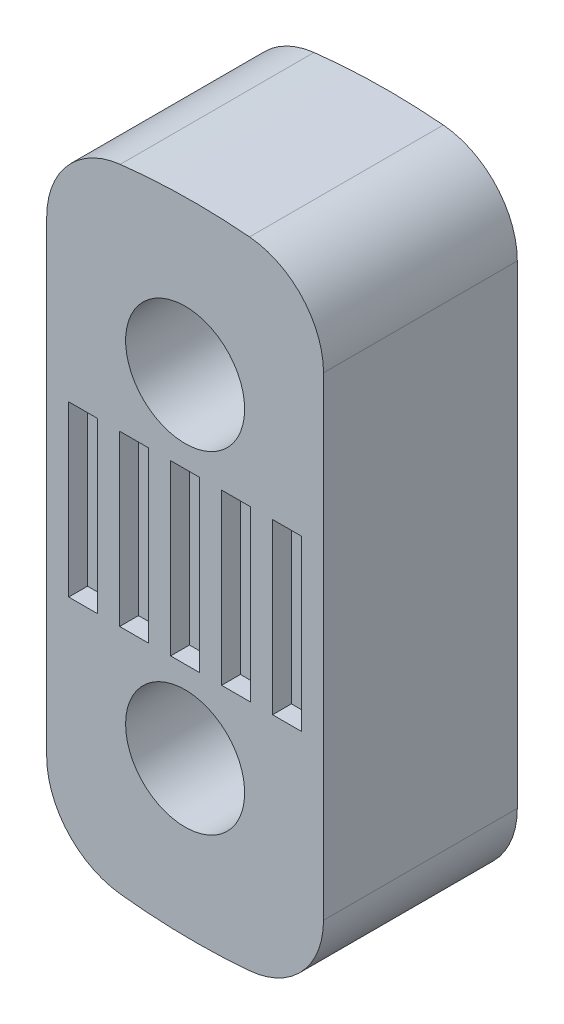
ISO-10303-21;
HEADER;
FILE_DESCRIPTION(('STEP AP214'),'2;1');
FILE_NAME('part.step','',(''),(''),'','','');
FILE_SCHEMA(('AUTOMOTIVE_DESIGN { 1 0 10303 214 1 1 1 1 }'));
ENDSEC;
DATA;
#1=APPLICATION_CONTEXT('core data for automotive mechanical design processes');
#2=APPLICATION_PROTOCOL_DEFINITION('international standard','automotive_design',2000,#1);
#3=PRODUCT_CONTEXT('',#1,'mechanical');
#4=PRODUCT('Part','Part','',(#3));
#5=PRODUCT_RELATED_PRODUCT_CATEGORY('part','',(#4));
#6=PRODUCT_DEFINITION_FORMATION('','',#4);
#7=PRODUCT_DEFINITION_CONTEXT('part definition',#1,'design');
#8=PRODUCT_DEFINITION('design','',#6,#7);
#9=PRODUCT_DEFINITION_SHAPE('','',#8);
#10=(LENGTH_UNIT() NAMED_UNIT(*) SI_UNIT(.MILLI.,.METRE.));
#11=(NAMED_UNIT(*) PLANE_ANGLE_UNIT() SI_UNIT($,.RADIAN.));
#12=(NAMED_UNIT(*) SI_UNIT($,.STERADIAN.) SOLID_ANGLE_UNIT());
#13=UNCERTAINTY_MEASURE_WITH_UNIT(LENGTH_MEASURE(1.E-05),#10,'distance_accuracy_value','');
#14=(GEOMETRIC_REPRESENTATION_CONTEXT(3) GLOBAL_UNCERTAINTY_ASSIGNED_CONTEXT((#13)) GLOBAL_UNIT_ASSIGNED_CONTEXT((#10,
#11,#12)) REPRESENTATION_CONTEXT('',''));
#15=CARTESIAN_POINT('',(0.,0.,0.));
#16=DIRECTION('',(0.,0.,1.));
#17=DIRECTION('',(1.,0.,0.));
#18=AXIS2_PLACEMENT_3D('',#15,#16,#17);
#19=CARTESIAN_POINT('',(-2.00158801806799,14.4344222229491,7.));
#20=DIRECTION('',(0.,0.,1.));
#21=DIRECTION('',(1.,0.,0.));
#22=AXIS2_PLACEMENT_3D('',#19,#20,#21);
#23=PLANE('',#22);
#24=DIRECTION('',(0.,-1.,0.));
#25=VECTOR('',#24,1.);
#26=CARTESIAN_POINT('',(3.15912,9.05440000000007,7.));
#27=LINE('',#26,#25);
#28=CARTESIAN_POINT('',(3.15912,9.05440000000007,7.));
#29=VERTEX_POINT('',#28);
#30=CARTESIAN_POINT('',(3.15912,2.94560000000003,7.));
#31=VERTEX_POINT('',#30);
#32=EDGE_CURVE('E57',#29,#31,#27,.T.);
#33=ORIENTED_EDGE('',*,*,#32,.F.);
#34=DIRECTION('',(-1.,0.,0.));
#35=VECTOR('',#34,1.);
#36=CARTESIAN_POINT('',(3.15912,9.05440000000007,7.));
#37=LINE('',#36,#35);
#38=CARTESIAN_POINT('',(4.2044,9.05440000000009,7.));
#39=VERTEX_POINT('',#38);
#40=EDGE_CURVE('E300',#39,#29,#37,.T.);
#41=ORIENTED_EDGE('',*,*,#40,.F.);
#42=DIRECTION('',(0.,1.,0.));
#43=VECTOR('',#42,1.);
#44=CARTESIAN_POINT('',(4.2044,9.05440000000009,7.));
#45=LINE('',#44,#43);
#46=CARTESIAN_POINT('',(4.2044,2.94560000000005,7.));
#47=VERTEX_POINT('',#46);
#48=EDGE_CURVE('E306',#47,#39,#45,.T.);
#49=ORIENTED_EDGE('',*,*,#48,.F.);
#50=DIRECTION('',(1.,0.,0.));
#51=VECTOR('',#50,1.);
#52=CARTESIAN_POINT('',(4.2044,2.94560000000005,7.));
#53=LINE('',#52,#51);
#54=EDGE_CURVE('E314',#31,#47,#53,.T.);
#55=ORIENTED_EDGE('',*,*,#54,.F.);
#56=EDGE_LOOP('',(#33,#41,#49,#55));
#57=FACE_BOUND('',#56,.T.);
#58=DIRECTION('',(0.,-1.,0.));
#59=VECTOR('',#58,1.);
#60=CARTESIAN_POINT('',(1.31824,9.05440000000004,7.));
#61=LINE('',#60,#59);
#62=CARTESIAN_POINT('',(1.31824,9.05440000000004,7.));
#63=VERTEX_POINT('',#62);
#64=CARTESIAN_POINT('',(1.31824,2.9456,7.));
#65=VERTEX_POINT('',#64);
#66=EDGE_CURVE('E68',#63,#65,#61,.T.);
#67=ORIENTED_EDGE('',*,*,#66,.F.);
#68=DIRECTION('',(-1.,0.,0.));
#69=VECTOR('',#68,1.);
#70=CARTESIAN_POINT('',(1.31824,9.05440000000004,7.));
#71=LINE('',#70,#69);
#72=CARTESIAN_POINT('',(2.36352,9.05440000000007,7.));
#73=VERTEX_POINT('',#72);
#74=EDGE_CURVE('E333',#73,#63,#71,.T.);
#75=ORIENTED_EDGE('',*,*,#74,.F.);
#76=DIRECTION('',(0.,1.,0.));
#77=VECTOR('',#76,1.);
#78=CARTESIAN_POINT('',(2.36352,9.05440000000007,7.));
#79=LINE('',#78,#77);
#80=CARTESIAN_POINT('',(2.36352,2.94560000000003,7.));
#81=VERTEX_POINT('',#80);
#82=EDGE_CURVE('E352',#81,#73,#79,.T.);
#83=ORIENTED_EDGE('',*,*,#82,.F.);
#84=DIRECTION('',(1.,0.,0.));
#85=VECTOR('',#84,1.);
#86=CARTESIAN_POINT('',(2.36352,2.94560000000003,7.));
#87=LINE('',#86,#85);
#88=EDGE_CURVE('E348',#65,#81,#87,.T.);
#89=ORIENTED_EDGE('',*,*,#88,.F.);
#90=EDGE_LOOP('',(#67,#75,#83,#89));
#91=FACE_BOUND('',#90,.T.);
#92=DIRECTION('',(0.,-1.,0.));
#93=VECTOR('',#92,1.);
#94=CARTESIAN_POINT('',(-0.522639999999999,9.05440000000002,7.));
#95=LINE('',#94,#93);
#96=CARTESIAN_POINT('',(-0.522639999999999,9.05440000000002,7.));
#97=VERTEX_POINT('',#96);
#98=CARTESIAN_POINT('',(-0.522639999999998,2.94559999999997,7.));
#99=VERTEX_POINT('',#98);
#100=EDGE_CURVE('E362',#97,#99,#95,.T.);
#101=ORIENTED_EDGE('',*,*,#100,.F.);
#102=DIRECTION('',(-1.,0.,0.));
#103=VECTOR('',#102,1.);
#104=CARTESIAN_POINT('',(-0.522639999999999,9.05440000000002,7.));
#105=LINE('',#104,#103);
#106=CARTESIAN_POINT('',(0.522640000000002,9.05440000000004,7.));
#107=VERTEX_POINT('',#106);
#108=EDGE_CURVE('E376',#107,#97,#105,.T.);
#109=ORIENTED_EDGE('',*,*,#108,.F.);
#110=DIRECTION('',(0.,1.,0.));
#111=VECTOR('',#110,1.);
#112=CARTESIAN_POINT('',(0.522640000000002,9.05440000000004,7.));
#113=LINE('',#112,#111);
#114=CARTESIAN_POINT('',(0.522640000000003,2.9456,7.));
#115=VERTEX_POINT('',#114);
#116=EDGE_CURVE('E395',#115,#107,#113,.T.);
#117=ORIENTED_EDGE('',*,*,#116,.F.);
#118=DIRECTION('',(1.,0.,0.));
#119=VECTOR('',#118,1.);
#120=CARTESIAN_POINT('',(0.522640000000003,2.9456,7.));
#121=LINE('',#120,#119);
#122=EDGE_CURVE('E391',#99,#115,#121,.T.);
#123=ORIENTED_EDGE('',*,*,#122,.F.);
#124=EDGE_LOOP('',(#101,#109,#117,#123));
#125=FACE_BOUND('',#124,.T.);
#126=DIRECTION('',(0.,-1.,0.));
#127=VECTOR('',#126,1.);
#128=CARTESIAN_POINT('',(-2.36352,9.05439999999999,7.));
#129=LINE('',#128,#127);
#130=CARTESIAN_POINT('',(-2.36352,9.05439999999999,7.));
#131=VERTEX_POINT('',#130);
#132=CARTESIAN_POINT('',(-2.36352,2.94559999999995,7.));
#133=VERTEX_POINT('',#132);
#134=EDGE_CURVE('E405',#131,#133,#129,.T.);
#135=ORIENTED_EDGE('',*,*,#134,.F.);
#136=DIRECTION('',(-1.,0.,0.));
#137=VECTOR('',#136,1.);
#138=CARTESIAN_POINT('',(-2.36352,9.05439999999999,7.));
#139=LINE('',#138,#137);
#140=CARTESIAN_POINT('',(-1.31824,9.05440000000002,7.));
#141=VERTEX_POINT('',#140);
#142=EDGE_CURVE('E420',#141,#131,#139,.T.);
#143=ORIENTED_EDGE('',*,*,#142,.F.);
#144=DIRECTION('',(0.,1.,0.));
#145=VECTOR('',#144,1.);
#146=CARTESIAN_POINT('',(-1.31824,9.05440000000002,7.));
#147=LINE('',#146,#145);
#148=CARTESIAN_POINT('',(-1.31824,2.94559999999997,7.));
#149=VERTEX_POINT('',#148);
#150=EDGE_CURVE('E438',#149,#141,#147,.T.);
#151=ORIENTED_EDGE('',*,*,#150,.F.);
#152=DIRECTION('',(1.,0.,0.));
#153=VECTOR('',#152,1.);
#154=CARTESIAN_POINT('',(-1.31824,2.94559999999997,7.));
#155=LINE('',#154,#153);
#156=EDGE_CURVE('E434',#133,#149,#155,.T.);
#157=ORIENTED_EDGE('',*,*,#156,.F.);
#158=EDGE_LOOP('',(#135,#143,#151,#157));
#159=FACE_BOUND('',#158,.T.);
#160=DIRECTION('',(0.,-1.,0.));
#161=VECTOR('',#160,1.);
#162=CARTESIAN_POINT('',(-4.2044,9.05439999999997,7.));
#163=LINE('',#162,#161);
#164=CARTESIAN_POINT('',(-4.2044,9.05439999999997,7.));
#165=VERTEX_POINT('',#164);
#166=CARTESIAN_POINT('',(-4.2044,2.94559999999992,7.));
#167=VERTEX_POINT('',#166);
#168=EDGE_CURVE('E448',#165,#167,#163,.T.);
#169=ORIENTED_EDGE('',*,*,#168,.F.);
#170=DIRECTION('',(-1.,0.,0.));
#171=VECTOR('',#170,1.);
#172=CARTESIAN_POINT('',(-4.2044,9.05439999999997,7.));
#173=LINE('',#172,#171);
#174=CARTESIAN_POINT('',(-3.15912,9.05439999999999,7.));
#175=VERTEX_POINT('',#174);
#176=EDGE_CURVE('E463',#175,#165,#173,.T.);
#177=ORIENTED_EDGE('',*,*,#176,.F.);
#178=DIRECTION('',(0.,1.,0.));
#179=VECTOR('',#178,1.);
#180=CARTESIAN_POINT('',(-3.15912,9.05439999999999,7.));
#181=LINE('',#180,#179);
#182=CARTESIAN_POINT('',(-3.15912,2.94559999999995,7.));
#183=VERTEX_POINT('',#182);
#184=EDGE_CURVE('E482',#183,#175,#181,.T.);
#185=ORIENTED_EDGE('',*,*,#184,.F.);
#186=DIRECTION('',(1.,0.,0.));
#187=VECTOR('',#186,1.);
#188=CARTESIAN_POINT('',(-3.15912,2.94559999999995,7.));
#189=LINE('',#188,#187);
#190=EDGE_CURVE('E478',#167,#183,#189,.T.);
#191=ORIENTED_EDGE('',*,*,#190,.F.);
#192=EDGE_LOOP('',(#169,#177,#185,#191));
#193=FACE_BOUND('',#192,.T.);
#194=CARTESIAN_POINT('',(0.,12.,7.));
#195=DIRECTION('',(0.,0.,1.));
#196=DIRECTION('',(1.,0.,0.));
#197=AXIS2_PLACEMENT_3D('',#194,#195,#196);
#198=CIRCLE('',#197,2.15);
#199=CARTESIAN_POINT('',(2.15000000000001,12.,7.));
#200=VERTEX_POINT('',#199);
#201=EDGE_CURVE('E510',#200,#200,#198,.T.);
#202=ORIENTED_EDGE('',*,*,#201,.F.);
#203=EDGE_LOOP('',(#202));
#204=FACE_BOUND('',#203,.T.);
#205=CARTESIAN_POINT('',(-2.00158801806799,14.4344222229491,7.));
#206=DIRECTION('',(0.,0.,1.));
#207=DIRECTION('',(1.,0.,0.));
#208=AXIS2_PLACEMENT_3D('',#205,#206,#207);
#209=CIRCLE('',#208,2.99841198193201);
#210=CARTESIAN_POINT('',(-2.34376728306027,17.4132454409335,7.));
#211=VERTEX_POINT('',#210);
#212=CARTESIAN_POINT('',(-5.,14.4344222229491,7.));
#213=VERTEX_POINT('',#212);
#214=EDGE_CURVE('E518',#211,#213,#209,.T.);
#215=ORIENTED_EDGE('',*,*,#214,.T.);
#216=DIRECTION('',(0.,-1.,0.));
#217=VECTOR('',#216,1.);
#218=CARTESIAN_POINT('',(-5.,14.4344222229491,7.));
#219=LINE('',#218,#217);
#220=CARTESIAN_POINT('',(-5.,-2.43442222294922,7.));
#221=VERTEX_POINT('',#220);
#222=EDGE_CURVE('E522',#213,#221,#219,.T.);
#223=ORIENTED_EDGE('',*,*,#222,.T.);
#224=CARTESIAN_POINT('',(-2.00158801806799,-2.43442222294922,7.));
#225=DIRECTION('',(0.,0.,1.));
#226=DIRECTION('',(-1.,0.,0.));
#227=AXIS2_PLACEMENT_3D('',#224,#225,#226);
#228=CIRCLE('',#227,2.99841198193201);
#229=CARTESIAN_POINT('',(-2.34376728306027,-5.41324544093359,7.));
#230=VERTEX_POINT('',#229);
#231=EDGE_CURVE('E526',#221,#230,#228,.T.);
#232=ORIENTED_EDGE('',*,*,#231,.T.);
#233=CARTESIAN_POINT('',(0.313805639653111,17.7221129386686,7.));
#234=DIRECTION('',(0.,0.,1.));
#235=DIRECTION('',(-1.,0.,0.));
#236=AXIS2_PLACEMENT_3D('',#233,#234,#235);
#237=CIRCLE('',#236,23.2874966707924);
#238=CARTESIAN_POINT('',(2.32681936940955,-5.47821630287409,7.));
#239=VERTEX_POINT('',#238);
#240=EDGE_CURVE('E529',#230,#239,#237,.T.);
#241=ORIENTED_EDGE('',*,*,#240,.T.);
#242=CARTESIAN_POINT('',(2.07388023446503,-2.56304929629146,7.));
#243=DIRECTION('',(0.,0.,1.));
#244=DIRECTION('',(-1.,0.,0.));
#245=AXIS2_PLACEMENT_3D('',#242,#243,#244);
#246=CIRCLE('',#245,2.92611976553497);
#247=CARTESIAN_POINT('',(5.,-2.56304929629146,7.));
#248=VERTEX_POINT('',#247);
#249=EDGE_CURVE('E531',#239,#248,#246,.T.);
#250=ORIENTED_EDGE('',*,*,#249,.T.);
#251=DIRECTION('',(0.,1.,0.));
#252=VECTOR('',#251,1.);
#253=CARTESIAN_POINT('',(5.,14.5630492962913,7.));
#254=LINE('',#253,#252);
#255=CARTESIAN_POINT('',(5.,14.5630492962913,7.));
#256=VERTEX_POINT('',#255);
#257=EDGE_CURVE('E533',#248,#256,#254,.T.);
#258=ORIENTED_EDGE('',*,*,#257,.T.);
#259=CARTESIAN_POINT('',(2.07388023446503,14.5630492962913,7.));
#260=DIRECTION('',(0.,0.,1.));
#261=DIRECTION('',(1.,0.,0.));
#262=AXIS2_PLACEMENT_3D('',#259,#260,#261);
#263=CIRCLE('',#262,2.92611976553497);
#264=CARTESIAN_POINT('',(2.32681936940955,17.478216302874,7.));
#265=VERTEX_POINT('',#264);
#266=EDGE_CURVE('E536',#256,#265,#263,.T.);
#267=ORIENTED_EDGE('',*,*,#266,.T.);
#268=CARTESIAN_POINT('',(0.313805639653111,-5.72211293866869,7.));
#269=DIRECTION('',(0.,0.,1.));
#270=DIRECTION('',(1.,0.,0.));
#271=AXIS2_PLACEMENT_3D('',#268,#269,#270);
#272=CIRCLE('',#271,23.2874966707924);
#273=EDGE_CURVE('E539',#265,#211,#272,.T.);
#274=ORIENTED_EDGE('',*,*,#273,.T.);
#275=EDGE_LOOP('',(#215,#223,#232,#241,#250,#258,#267,#274));
#276=FACE_BOUND('',#275,.T.);
#277=CARTESIAN_POINT('',(0.,0.,7.));
#278=DIRECTION('',(0.,0.,1.));
#279=DIRECTION('',(-1.,0.,0.));
#280=AXIS2_PLACEMENT_3D('',#277,#278,#279);
#281=CIRCLE('',#280,2.15);
#282=CARTESIAN_POINT('',(-2.15,0.,7.));
#283=VERTEX_POINT('',#282);
#284=EDGE_CURVE('E502',#283,#283,#281,.T.);
#285=ORIENTED_EDGE('',*,*,#284,.F.);
#286=EDGE_LOOP('',(#285));
#287=FACE_BOUND('',#286,.T.);
#288=ADVANCED_FACE('F38',(#57,#91,#125,#159,#193,#204,#276,#287),#23,.T.);
#289=CARTESIAN_POINT('',(-2.00158801806799,14.4344222229491,0.));
#290=DIRECTION('',(0.,0.,1.));
#291=DIRECTION('',(1.,0.,0.));
#292=AXIS2_PLACEMENT_3D('',#289,#290,#291);
#293=PLANE('',#292);
#294=CARTESIAN_POINT('',(0.,12.,0.));
#295=DIRECTION('',(0.,0.,1.));
#296=DIRECTION('',(1.,0.,0.));
#297=AXIS2_PLACEMENT_3D('',#294,#295,#296);
#298=CIRCLE('',#297,2.15);
#299=CARTESIAN_POINT('',(2.15000000000001,12.,0.));
#300=VERTEX_POINT('',#299);
#301=EDGE_CURVE('E506',#300,#300,#298,.T.);
#302=ORIENTED_EDGE('',*,*,#301,.T.);
#303=EDGE_LOOP('',(#302));
#304=FACE_BOUND('',#303,.T.);
#305=CARTESIAN_POINT('',(-2.00158801806799,14.4344222229491,0.));
#306=DIRECTION('',(0.,0.,1.));
#307=DIRECTION('',(1.,0.,0.));
#308=AXIS2_PLACEMENT_3D('',#305,#306,#307);
#309=CIRCLE('',#308,2.99841198193201);
#310=CARTESIAN_POINT('',(-2.34376728306027,17.4132454409335,0.));
#311=VERTEX_POINT('',#310);
#312=CARTESIAN_POINT('',(-5.,14.4344222229491,0.));
#313=VERTEX_POINT('',#312);
#314=EDGE_CURVE('E514',#311,#313,#309,.T.);
#315=ORIENTED_EDGE('',*,*,#314,.F.);
#316=CARTESIAN_POINT('',(0.313805639653111,-5.72211293866869,0.));
#317=DIRECTION('',(0.,0.,1.));
#318=DIRECTION('',(1.,0.,0.));
#319=AXIS2_PLACEMENT_3D('',#316,#317,#318);
#320=CIRCLE('',#319,23.2874966707924);
#321=CARTESIAN_POINT('',(2.32681936940955,17.478216302874,0.));
#322=VERTEX_POINT('',#321);
#323=EDGE_CURVE('E523',#322,#311,#320,.T.);
#324=ORIENTED_EDGE('',*,*,#323,.F.);
#325=CARTESIAN_POINT('',(2.07388023446503,14.5630492962913,0.));
#326=DIRECTION('',(0.,0.,1.));
#327=DIRECTION('',(1.,0.,0.));
#328=AXIS2_PLACEMENT_3D('',#325,#326,#327);
#329=CIRCLE('',#328,2.92611976553497);
#330=CARTESIAN_POINT('',(5.,14.5630492962913,0.));
#331=VERTEX_POINT('',#330);
#332=EDGE_CURVE('E562',#331,#322,#329,.T.);
#333=ORIENTED_EDGE('',*,*,#332,.F.);
#334=DIRECTION('',(0.,1.,0.));
#335=VECTOR('',#334,1.);
#336=CARTESIAN_POINT('',(5.,14.5630492962913,0.));
#337=LINE('',#336,#335);
#338=CARTESIAN_POINT('',(5.,-2.56304929629146,0.));
#339=VERTEX_POINT('',#338);
#340=EDGE_CURVE('E559',#339,#331,#337,.T.);
#341=ORIENTED_EDGE('',*,*,#340,.F.);
#342=CARTESIAN_POINT('',(2.07388023446503,-2.56304929629146,0.));
#343=DIRECTION('',(0.,0.,1.));
#344=DIRECTION('',(-1.,0.,0.));
#345=AXIS2_PLACEMENT_3D('',#342,#343,#344);
#346=CIRCLE('',#345,2.92611976553497);
#347=CARTESIAN_POINT('',(2.32681936940955,-5.47821630287409,0.));
#348=VERTEX_POINT('',#347);
#349=EDGE_CURVE('E556',#348,#339,#346,.T.);
#350=ORIENTED_EDGE('',*,*,#349,.F.);
#351=CARTESIAN_POINT('',(0.313805639653111,17.7221129386686,0.));
#352=DIRECTION('',(0.,0.,1.));
#353=DIRECTION('',(-1.,0.,0.));
#354=AXIS2_PLACEMENT_3D('',#351,#352,#353);
#355=CIRCLE('',#354,23.2874966707924);
#356=CARTESIAN_POINT('',(-2.34376728306027,-5.41324544093359,0.));
#357=VERTEX_POINT('',#356);
#358=EDGE_CURVE('E553',#357,#348,#355,.T.);
#359=ORIENTED_EDGE('',*,*,#358,.F.);
#360=CARTESIAN_POINT('',(-2.00158801806799,-2.43442222294922,0.));
#361=DIRECTION('',(0.,0.,1.));
#362=DIRECTION('',(-1.,0.,0.));
#363=AXIS2_PLACEMENT_3D('',#360,#361,#362);
#364=CIRCLE('',#363,2.99841198193201);
#365=CARTESIAN_POINT('',(-5.,-2.43442222294922,0.));
#366=VERTEX_POINT('',#365);
#367=EDGE_CURVE('E549',#366,#357,#364,.T.);
#368=ORIENTED_EDGE('',*,*,#367,.F.);
#369=DIRECTION('',(0.,-1.,0.));
#370=VECTOR('',#369,1.);
#371=CARTESIAN_POINT('',(-5.,14.4344222229491,0.));
#372=LINE('',#371,#370);
#373=EDGE_CURVE('E546',#313,#366,#372,.T.);
#374=ORIENTED_EDGE('',*,*,#373,.F.);
#375=EDGE_LOOP('',(#315,#324,#333,#341,#350,#359,#368,#374));
#376=FACE_BOUND('',#375,.T.);
#377=CARTESIAN_POINT('',(0.,0.,0.));
#378=DIRECTION('',(0.,0.,1.));
#379=DIRECTION('',(-1.,0.,0.));
#380=AXIS2_PLACEMENT_3D('',#377,#378,#379);
#381=CIRCLE('',#380,2.15);
#382=CARTESIAN_POINT('',(-2.15,0.,0.));
#383=VERTEX_POINT('',#382);
#384=EDGE_CURVE('E492',#383,#383,#381,.T.);
#385=ORIENTED_EDGE('',*,*,#384,.T.);
#386=EDGE_LOOP('',(#385));
#387=FACE_BOUND('',#386,.T.);
#388=ADVANCED_FACE('F598',(#304,#376,#387),#293,.F.);
#389=CARTESIAN_POINT('',(-2.00158801806799,14.4344222229491,7.));
#390=DIRECTION('',(0.,0.,-1.));
#391=DIRECTION('',(-1.,0.,0.));
#392=AXIS2_PLACEMENT_3D('',#389,#390,#391);
#393=CYLINDRICAL_SURFACE('',#392,2.99841198193201);
#394=ORIENTED_EDGE('',*,*,#314,.T.);
#395=DIRECTION('',(0.,0.,-1.));
#396=VECTOR('',#395,1.);
#397=CARTESIAN_POINT('',(-5.,14.4344222229491,7.));
#398=LINE('',#397,#396);
#399=EDGE_CURVE('E11',#213,#313,#398,.T.);
#400=ORIENTED_EDGE('',*,*,#399,.F.);
#401=ORIENTED_EDGE('',*,*,#214,.F.);
#402=DIRECTION('',(0.,0.,-1.));
#403=VECTOR('',#402,1.);
#404=CARTESIAN_POINT('',(-2.34376728306027,17.4132454409335,7.));
#405=LINE('',#404,#403);
#406=EDGE_CURVE('E542',#211,#311,#405,.T.);
#407=ORIENTED_EDGE('',*,*,#406,.T.);
#408=EDGE_LOOP('',(#394,#400,#401,#407));
#409=FACE_BOUND('',#408,.T.);
#410=ADVANCED_FACE('F40',(#409),#393,.T.);
#411=CARTESIAN_POINT('',(-5.,14.4344222229491,7.));
#412=DIRECTION('',(1.,0.,0.));
#413=DIRECTION('',(0.,1.,0.));
#414=AXIS2_PLACEMENT_3D('',#411,#412,#413);
#415=PLANE('',#414);
#416=ORIENTED_EDGE('',*,*,#373,.T.);
#417=DIRECTION('',(0.,0.,-1.));
#418=VECTOR('',#417,1.);
#419=CARTESIAN_POINT('',(-5.,-2.43442222294922,7.));
#420=LINE('',#419,#418);
#421=EDGE_CURVE('E47',#221,#366,#420,.T.);
#422=ORIENTED_EDGE('',*,*,#421,.F.);
#423=ORIENTED_EDGE('',*,*,#222,.F.);
#424=ORIENTED_EDGE('',*,*,#399,.T.);
#425=EDGE_LOOP('',(#416,#422,#423,#424));
#426=FACE_BOUND('',#425,.T.);
#427=ADVANCED_FACE('F616',(#426),#415,.F.);
#428=CARTESIAN_POINT('',(-2.00158801806799,-2.43442222294922,7.));
#429=DIRECTION('',(0.,0.,-1.));
#430=DIRECTION('',(-1.,0.,0.));
#431=AXIS2_PLACEMENT_3D('',#428,#429,#430);
#432=CYLINDRICAL_SURFACE('',#431,2.99841198193201);
#433=ORIENTED_EDGE('',*,*,#367,.T.);
#434=DIRECTION('',(0.,0.,-1.));
#435=VECTOR('',#434,1.);
#436=CARTESIAN_POINT('',(-2.34376728306027,-5.41324544093359,7.));
#437=LINE('',#436,#435);
#438=EDGE_CURVE('E585',#230,#357,#437,.T.);
#439=ORIENTED_EDGE('',*,*,#438,.F.);
#440=ORIENTED_EDGE('',*,*,#231,.F.);
#441=ORIENTED_EDGE('',*,*,#421,.T.);
#442=EDGE_LOOP('',(#433,#439,#440,#441));
#443=FACE_BOUND('',#442,.T.);
#444=ADVANCED_FACE('F593',(#443),#432,.T.);
#445=CARTESIAN_POINT('',(0.313805639653111,17.7221129386686,7.));
#446=DIRECTION('',(0.,0.,-1.));
#447=DIRECTION('',(-1.,0.,0.));
#448=AXIS2_PLACEMENT_3D('',#445,#446,#447);
#449=CYLINDRICAL_SURFACE('',#448,23.2874966707924);
#450=ORIENTED_EDGE('',*,*,#358,.T.);
#451=DIRECTION('',(0.,0.,-1.));
#452=VECTOR('',#451,1.);
#453=CARTESIAN_POINT('',(2.32681936940955,-5.47821630287409,7.));
#454=LINE('',#453,#452);
#455=EDGE_CURVE('E582',#239,#348,#454,.T.);
#456=ORIENTED_EDGE('',*,*,#455,.F.);
#457=ORIENTED_EDGE('',*,*,#240,.F.);
#458=ORIENTED_EDGE('',*,*,#438,.T.);
#459=EDGE_LOOP('',(#450,#456,#457,#458));
#460=FACE_BOUND('',#459,.T.);
#461=ADVANCED_FACE('F604',(#460),#449,.T.);
#462=CARTESIAN_POINT('',(2.07388023446503,-2.56304929629146,7.));
#463=DIRECTION('',(0.,0.,-1.));
#464=DIRECTION('',(-1.,0.,0.));
#465=AXIS2_PLACEMENT_3D('',#462,#463,#464);
#466=CYLINDRICAL_SURFACE('',#465,2.92611976553497);
#467=ORIENTED_EDGE('',*,*,#349,.T.);
#468=DIRECTION('',(0.,0.,-1.));
#469=VECTOR('',#468,1.);
#470=CARTESIAN_POINT('',(5.,-2.56304929629146,7.));
#471=LINE('',#470,#469);
#472=EDGE_CURVE('E579',#248,#339,#471,.T.);
#473=ORIENTED_EDGE('',*,*,#472,.F.);
#474=ORIENTED_EDGE('',*,*,#249,.F.);
#475=ORIENTED_EDGE('',*,*,#455,.T.);
#476=EDGE_LOOP('',(#467,#473,#474,#475));
#477=FACE_BOUND('',#476,.T.);
#478=ADVANCED_FACE('F608',(#477),#466,.T.);
#479=CARTESIAN_POINT('',(5.,14.5630492962913,7.));
#480=DIRECTION('',(-1.,0.,0.));
#481=DIRECTION('',(0.,-1.,0.));
#482=AXIS2_PLACEMENT_3D('',#479,#480,#481);
#483=PLANE('',#482);
#484=ORIENTED_EDGE('',*,*,#340,.T.);
#485=DIRECTION('',(0.,0.,-1.));
#486=VECTOR('',#485,1.);
#487=CARTESIAN_POINT('',(5.,14.5630492962913,7.));
#488=LINE('',#487,#486);
#489=EDGE_CURVE('E575',#256,#331,#488,.T.);
#490=ORIENTED_EDGE('',*,*,#489,.F.);
#491=ORIENTED_EDGE('',*,*,#257,.F.);
#492=ORIENTED_EDGE('',*,*,#472,.T.);
#493=EDGE_LOOP('',(#484,#490,#491,#492));
#494=FACE_BOUND('',#493,.T.);
#495=ADVANCED_FACE('F637',(#494),#483,.F.);
#496=CARTESIAN_POINT('',(2.07388023446503,14.5630492962913,7.));
#497=DIRECTION('',(0.,0.,-1.));
#498=DIRECTION('',(-1.,0.,0.));
#499=AXIS2_PLACEMENT_3D('',#496,#497,#498);
#500=CYLINDRICAL_SURFACE('',#499,2.92611976553497);
#501=ORIENTED_EDGE('',*,*,#332,.T.);
#502=DIRECTION('',(0.,0.,-1.));
#503=VECTOR('',#502,1.);
#504=CARTESIAN_POINT('',(2.32681936940955,17.478216302874,7.));
#505=LINE('',#504,#503);
#506=EDGE_CURVE('E571',#265,#322,#505,.T.);
#507=ORIENTED_EDGE('',*,*,#506,.F.);
#508=ORIENTED_EDGE('',*,*,#266,.F.);
#509=ORIENTED_EDGE('',*,*,#489,.T.);
#510=EDGE_LOOP('',(#501,#507,#508,#509));
#511=FACE_BOUND('',#510,.T.);
#512=ADVANCED_FACE('F623',(#511),#500,.T.);
#513=CARTESIAN_POINT('',(0.313805639653111,-5.72211293866869,7.));
#514=DIRECTION('',(0.,0.,-1.));
#515=DIRECTION('',(-1.,0.,0.));
#516=AXIS2_PLACEMENT_3D('',#513,#514,#515);
#517=CYLINDRICAL_SURFACE('',#516,23.2874966707924);
#518=ORIENTED_EDGE('',*,*,#323,.T.);
#519=ORIENTED_EDGE('',*,*,#406,.F.);
#520=ORIENTED_EDGE('',*,*,#273,.F.);
#521=ORIENTED_EDGE('',*,*,#506,.T.);
#522=EDGE_LOOP('',(#518,#519,#520,#521));
#523=FACE_BOUND('',#522,.T.);
#524=ADVANCED_FACE('F626',(#523),#517,.T.);
#525=CARTESIAN_POINT('',(0.,12.,7.));
#526=DIRECTION('',(0.,0.,-1.));
#527=DIRECTION('',(-1.,0.,0.));
#528=AXIS2_PLACEMENT_3D('',#525,#526,#527);
#529=CYLINDRICAL_SURFACE('',#528,2.15);
#530=ORIENTED_EDGE('',*,*,#201,.T.);
#531=EDGE_LOOP('',(#530));
#532=FACE_BOUND('',#531,.T.);
#533=ORIENTED_EDGE('',*,*,#301,.F.);
#534=EDGE_LOOP('',(#533));
#535=FACE_BOUND('',#534,.T.);
#536=ADVANCED_FACE('F628',(#532,#535),#529,.F.);
#537=CARTESIAN_POINT('',(0.,0.,7.));
#538=DIRECTION('',(0.,0.,-1.));
#539=DIRECTION('',(-1.,0.,0.));
#540=AXIS2_PLACEMENT_3D('',#537,#538,#539);
#541=CYLINDRICAL_SURFACE('',#540,2.15);
#542=ORIENTED_EDGE('',*,*,#284,.T.);
#543=EDGE_LOOP('',(#542));
#544=FACE_BOUND('',#543,.T.);
#545=ORIENTED_EDGE('',*,*,#384,.F.);
#546=EDGE_LOOP('',(#545));
#547=FACE_BOUND('',#546,.T.);
#548=ADVANCED_FACE('F634',(#544,#547),#541,.F.);
#549=CARTESIAN_POINT('',(-4.2044,9.05439999999997,6.32));
#550=DIRECTION('',(-1.,0.,0.));
#551=DIRECTION('',(0.,0.,1.));
#552=AXIS2_PLACEMENT_3D('',#549,#550,#551);
#553=PLANE('',#552);
#554=ORIENTED_EDGE('',*,*,#168,.T.);
#555=DIRECTION('',(0.,0.,1.));
#556=VECTOR('',#555,1.);
#557=CARTESIAN_POINT('',(-4.2044,2.94559999999992,6.32));
#558=LINE('',#557,#556);
#559=CARTESIAN_POINT('',(-4.2044,2.94559999999992,6.32));
#560=VERTEX_POINT('',#559);
#561=EDGE_CURVE('E475',#560,#167,#558,.T.);
#562=ORIENTED_EDGE('',*,*,#561,.F.);
#563=DIRECTION('',(0.,-1.,0.));
#564=VECTOR('',#563,1.);
#565=CARTESIAN_POINT('',(-4.2044,9.05439999999997,6.32));
#566=LINE('',#565,#564);
#567=CARTESIAN_POINT('',(-4.2044,9.05439999999997,6.32));
#568=VERTEX_POINT('',#567);
#569=EDGE_CURVE('E458',#568,#560,#566,.T.);
#570=ORIENTED_EDGE('',*,*,#569,.F.);
#571=DIRECTION('',(0.,0.,1.));
#572=VECTOR('',#571,1.);
#573=CARTESIAN_POINT('',(-4.2044,9.05439999999997,6.32));
#574=LINE('',#573,#572);
#575=EDGE_CURVE('E489',#568,#165,#574,.T.);
#576=ORIENTED_EDGE('',*,*,#575,.T.);
#577=EDGE_LOOP('',(#554,#562,#570,#576));
#578=FACE_BOUND('',#577,.T.);
#579=ADVANCED_FACE('F651',(#578),#553,.F.);
#580=CARTESIAN_POINT('',(-4.2044,9.05439999999997,6.32));
#581=DIRECTION('',(0.,1.,0.));
#582=DIRECTION('',(-1.,0.,0.));
#583=AXIS2_PLACEMENT_3D('',#580,#581,#582);
#584=PLANE('',#583);
#585=ORIENTED_EDGE('',*,*,#176,.T.);
#586=ORIENTED_EDGE('',*,*,#575,.F.);
#587=DIRECTION('',(-1.,0.,0.));
#588=VECTOR('',#587,1.);
#589=CARTESIAN_POINT('',(-4.2044,9.05439999999997,6.32));
#590=LINE('',#589,#588);
#591=CARTESIAN_POINT('',(-3.15912,9.05439999999999,6.32));
#592=VERTEX_POINT('',#591);
#593=EDGE_CURVE('E471',#592,#568,#590,.T.);
#594=ORIENTED_EDGE('',*,*,#593,.F.);
#595=DIRECTION('',(0.,0.,1.));
#596=VECTOR('',#595,1.);
#597=CARTESIAN_POINT('',(-3.15912,9.05439999999999,6.32));
#598=LINE('',#597,#596);
#599=EDGE_CURVE('E493',#592,#175,#598,.T.);
#600=ORIENTED_EDGE('',*,*,#599,.T.);
#601=EDGE_LOOP('',(#585,#586,#594,#600));
#602=FACE_BOUND('',#601,.T.);
#603=ADVANCED_FACE('F655',(#602),#584,.F.);
#604=CARTESIAN_POINT('',(-3.15912,9.05439999999999,6.32));
#605=DIRECTION('',(1.,0.,0.));
#606=DIRECTION('',(0.,1.,0.));
#607=AXIS2_PLACEMENT_3D('',#604,#605,#606);
#608=PLANE('',#607);
#609=ORIENTED_EDGE('',*,*,#184,.T.);
#610=ORIENTED_EDGE('',*,*,#599,.F.);
#611=DIRECTION('',(0.,1.,0.));
#612=VECTOR('',#611,1.);
#613=CARTESIAN_POINT('',(-3.15912,9.05439999999999,6.32));
#614=LINE('',#613,#612);
#615=CARTESIAN_POINT('',(-3.15912,2.94559999999995,6.32));
#616=VERTEX_POINT('',#615);
#617=EDGE_CURVE('E467',#616,#592,#614,.T.);
#618=ORIENTED_EDGE('',*,*,#617,.F.);
#619=DIRECTION('',(0.,0.,1.));
#620=VECTOR('',#619,1.);
#621=CARTESIAN_POINT('',(-3.15912,2.94559999999995,6.32));
#622=LINE('',#621,#620);
#623=EDGE_CURVE('E496',#616,#183,#622,.T.);
#624=ORIENTED_EDGE('',*,*,#623,.T.);
#625=EDGE_LOOP('',(#609,#610,#618,#624));
#626=FACE_BOUND('',#625,.T.);
#627=ADVANCED_FACE('F661',(#626),#608,.F.);
#628=CARTESIAN_POINT('',(-3.15912,2.94559999999995,6.32));
#629=DIRECTION('',(0.,-1.,0.));
#630=DIRECTION('',(1.,0.,0.));
#631=AXIS2_PLACEMENT_3D('',#628,#629,#630);
#632=PLANE('',#631);
#633=ORIENTED_EDGE('',*,*,#190,.T.);
#634=ORIENTED_EDGE('',*,*,#623,.F.);
#635=DIRECTION('',(1.,0.,0.));
#636=VECTOR('',#635,1.);
#637=CARTESIAN_POINT('',(-3.15912,2.94559999999995,6.32));
#638=LINE('',#637,#636);
#639=EDGE_CURVE('E462',#560,#616,#638,.T.);
#640=ORIENTED_EDGE('',*,*,#639,.F.);
#641=ORIENTED_EDGE('',*,*,#561,.T.);
#642=EDGE_LOOP('',(#633,#634,#640,#641));
#643=FACE_BOUND('',#642,.T.);
#644=ADVANCED_FACE('F657',(#643),#632,.F.);
#645=CARTESIAN_POINT('',(0.,0.,6.32));
#646=DIRECTION('',(0.,0.,-1.));
#647=DIRECTION('',(-1.,0.,0.));
#648=AXIS2_PLACEMENT_3D('',#645,#646,#647);
#649=PLANE('',#648);
#650=ORIENTED_EDGE('',*,*,#569,.T.);
#651=ORIENTED_EDGE('',*,*,#639,.T.);
#652=ORIENTED_EDGE('',*,*,#617,.T.);
#653=ORIENTED_EDGE('',*,*,#593,.T.);
#654=EDGE_LOOP('',(#650,#651,#652,#653));
#655=FACE_BOUND('',#654,.T.);
#656=ADVANCED_FACE('F660',(#655),#649,.F.);
#657=CARTESIAN_POINT('',(-2.36352,9.05439999999999,6.32));
#658=DIRECTION('',(-1.,0.,0.));
#659=DIRECTION('',(0.,-1.,0.));
#660=AXIS2_PLACEMENT_3D('',#657,#658,#659);
#661=PLANE('',#660);
#662=ORIENTED_EDGE('',*,*,#134,.T.);
#663=DIRECTION('',(0.,0.,1.));
#664=VECTOR('',#663,1.);
#665=CARTESIAN_POINT('',(-2.36352,2.94559999999995,6.32));
#666=LINE('',#665,#664);
#667=CARTESIAN_POINT('',(-2.36352,2.94559999999995,6.32));
#668=VERTEX_POINT('',#667);
#669=EDGE_CURVE('E431',#668,#133,#666,.T.);
#670=ORIENTED_EDGE('',*,*,#669,.F.);
#671=DIRECTION('',(0.,-1.,0.));
#672=VECTOR('',#671,1.);
#673=CARTESIAN_POINT('',(-2.36352,9.05439999999999,6.32));
#674=LINE('',#673,#672);
#675=CARTESIAN_POINT('',(-2.36352,9.05439999999999,6.32));
#676=VERTEX_POINT('',#675);
#677=EDGE_CURVE('E415',#676,#668,#674,.T.);
#678=ORIENTED_EDGE('',*,*,#677,.F.);
#679=DIRECTION('',(0.,0.,1.));
#680=VECTOR('',#679,1.);
#681=CARTESIAN_POINT('',(-2.36352,9.05439999999999,6.32));
#682=LINE('',#681,#680);
#683=EDGE_CURVE('E445',#676,#131,#682,.T.);
#684=ORIENTED_EDGE('',*,*,#683,.T.);
#685=EDGE_LOOP('',(#662,#670,#678,#684));
#686=FACE_BOUND('',#685,.T.);
#687=ADVANCED_FACE('F671',(#686),#661,.F.);
#688=CARTESIAN_POINT('',(-2.36352,9.05439999999999,6.32));
#689=DIRECTION('',(0.,1.,0.));
#690=DIRECTION('',(-1.,0.,0.));
#691=AXIS2_PLACEMENT_3D('',#688,#689,#690);
#692=PLANE('',#691);
#693=ORIENTED_EDGE('',*,*,#142,.T.);
#694=ORIENTED_EDGE('',*,*,#683,.F.);
#695=DIRECTION('',(-1.,0.,0.));
#696=VECTOR('',#695,1.);
#697=CARTESIAN_POINT('',(-2.36352,9.05439999999999,6.32));
#698=LINE('',#697,#696);
#699=CARTESIAN_POINT('',(-1.31824,9.05440000000002,6.32));
#700=VERTEX_POINT('',#699);
#701=EDGE_CURVE('E427',#700,#676,#698,.T.);
#702=ORIENTED_EDGE('',*,*,#701,.F.);
#703=DIRECTION('',(0.,0.,1.));
#704=VECTOR('',#703,1.);
#705=CARTESIAN_POINT('',(-1.31824,9.05440000000002,6.32));
#706=LINE('',#705,#704);
#707=EDGE_CURVE('E449',#700,#141,#706,.T.);
#708=ORIENTED_EDGE('',*,*,#707,.T.);
#709=EDGE_LOOP('',(#693,#694,#702,#708));
#710=FACE_BOUND('',#709,.T.);
#711=ADVANCED_FACE('F675',(#710),#692,.F.);
#712=CARTESIAN_POINT('',(-1.31824,9.05440000000002,6.32));
#713=DIRECTION('',(1.,0.,0.));
#714=DIRECTION('',(0.,1.,0.));
#715=AXIS2_PLACEMENT_3D('',#712,#713,#714);
#716=PLANE('',#715);
#717=ORIENTED_EDGE('',*,*,#150,.T.);
#718=ORIENTED_EDGE('',*,*,#707,.F.);
#719=DIRECTION('',(0.,1.,0.));
#720=VECTOR('',#719,1.);
#721=CARTESIAN_POINT('',(-1.31824,9.05440000000002,6.32));
#722=LINE('',#721,#720);
#723=CARTESIAN_POINT('',(-1.31824,2.94559999999997,6.32));
#724=VERTEX_POINT('',#723);
#725=EDGE_CURVE('E423',#724,#700,#722,.T.);
#726=ORIENTED_EDGE('',*,*,#725,.F.);
#727=DIRECTION('',(0.,0.,1.));
#728=VECTOR('',#727,1.);
#729=CARTESIAN_POINT('',(-1.31824,2.94559999999997,6.32));
#730=LINE('',#729,#728);
#731=EDGE_CURVE('E452',#724,#149,#730,.T.);
#732=ORIENTED_EDGE('',*,*,#731,.T.);
#733=EDGE_LOOP('',(#717,#718,#726,#732));
#734=FACE_BOUND('',#733,.T.);
#735=ADVANCED_FACE('F681',(#734),#716,.F.);
#736=CARTESIAN_POINT('',(-1.31824,2.94559999999997,6.32));
#737=DIRECTION('',(0.,-1.,0.));
#738=DIRECTION('',(1.,0.,0.));
#739=AXIS2_PLACEMENT_3D('',#736,#737,#738);
#740=PLANE('',#739);
#741=ORIENTED_EDGE('',*,*,#156,.T.);
#742=ORIENTED_EDGE('',*,*,#731,.F.);
#743=DIRECTION('',(1.,0.,0.));
#744=VECTOR('',#743,1.);
#745=CARTESIAN_POINT('',(-1.31824,2.94559999999997,6.32));
#746=LINE('',#745,#744);
#747=EDGE_CURVE('E419',#668,#724,#746,.T.);
#748=ORIENTED_EDGE('',*,*,#747,.F.);
#749=ORIENTED_EDGE('',*,*,#669,.T.);
#750=EDGE_LOOP('',(#741,#742,#748,#749));
#751=FACE_BOUND('',#750,.T.);
#752=ADVANCED_FACE('F677',(#751),#740,.F.);
#753=CARTESIAN_POINT('',(0.,0.,6.32));
#754=DIRECTION('',(0.,0.,-1.));
#755=DIRECTION('',(-1.,0.,0.));
#756=AXIS2_PLACEMENT_3D('',#753,#754,#755);
#757=PLANE('',#756);
#758=ORIENTED_EDGE('',*,*,#677,.T.);
#759=ORIENTED_EDGE('',*,*,#747,.T.);
#760=ORIENTED_EDGE('',*,*,#725,.T.);
#761=ORIENTED_EDGE('',*,*,#701,.T.);
#762=EDGE_LOOP('',(#758,#759,#760,#761));
#763=FACE_BOUND('',#762,.T.);
#764=ADVANCED_FACE('F680',(#763),#757,.F.);
#765=CARTESIAN_POINT('',(-0.522639999999999,9.05440000000002,6.32));
#766=DIRECTION('',(-1.,0.,0.));
#767=DIRECTION('',(0.,-1.,0.));
#768=AXIS2_PLACEMENT_3D('',#765,#766,#767);
#769=PLANE('',#768);
#770=ORIENTED_EDGE('',*,*,#100,.T.);
#771=DIRECTION('',(0.,0.,1.));
#772=VECTOR('',#771,1.);
#773=CARTESIAN_POINT('',(-0.522639999999998,2.94559999999997,6.32));
#774=LINE('',#773,#772);
#775=CARTESIAN_POINT('',(-0.522639999999998,2.94559999999997,6.32));
#776=VERTEX_POINT('',#775);
#777=EDGE_CURVE('E388',#776,#99,#774,.T.);
#778=ORIENTED_EDGE('',*,*,#777,.F.);
#779=DIRECTION('',(0.,-1.,0.));
#780=VECTOR('',#779,1.);
#781=CARTESIAN_POINT('',(-0.522639999999999,9.05440000000002,6.32));
#782=LINE('',#781,#780);
#783=CARTESIAN_POINT('',(-0.522639999999999,9.05440000000002,6.32));
#784=VERTEX_POINT('',#783);
#785=EDGE_CURVE('E371',#784,#776,#782,.T.);
#786=ORIENTED_EDGE('',*,*,#785,.F.);
#787=DIRECTION('',(0.,0.,1.));
#788=VECTOR('',#787,1.);
#789=CARTESIAN_POINT('',(-0.522639999999999,9.05440000000002,6.32));
#790=LINE('',#789,#788);
#791=EDGE_CURVE('E402',#784,#97,#790,.T.);
#792=ORIENTED_EDGE('',*,*,#791,.T.);
#793=EDGE_LOOP('',(#770,#778,#786,#792));
#794=FACE_BOUND('',#793,.T.);
#795=ADVANCED_FACE('F691',(#794),#769,.F.);
#796=CARTESIAN_POINT('',(-0.522639999999999,9.05440000000002,6.32));
#797=DIRECTION('',(0.,1.,0.));
#798=DIRECTION('',(-1.,0.,0.));
#799=AXIS2_PLACEMENT_3D('',#796,#797,#798);
#800=PLANE('',#799);
#801=ORIENTED_EDGE('',*,*,#108,.T.);
#802=ORIENTED_EDGE('',*,*,#791,.F.);
#803=DIRECTION('',(-1.,0.,0.));
#804=VECTOR('',#803,1.);
#805=CARTESIAN_POINT('',(-0.522639999999999,9.05440000000002,6.32));
#806=LINE('',#805,#804);
#807=CARTESIAN_POINT('',(0.522640000000002,9.05440000000004,6.32));
#808=VERTEX_POINT('',#807);
#809=EDGE_CURVE('E384',#808,#784,#806,.T.);
#810=ORIENTED_EDGE('',*,*,#809,.F.);
#811=DIRECTION('',(0.,0.,1.));
#812=VECTOR('',#811,1.);
#813=CARTESIAN_POINT('',(0.522640000000002,9.05440000000004,6.32));
#814=LINE('',#813,#812);
#815=EDGE_CURVE('E406',#808,#107,#814,.T.);
#816=ORIENTED_EDGE('',*,*,#815,.T.);
#817=EDGE_LOOP('',(#801,#802,#810,#816));
#818=FACE_BOUND('',#817,.T.);
#819=ADVANCED_FACE('F695',(#818),#800,.F.);
#820=CARTESIAN_POINT('',(0.522640000000002,9.05440000000004,6.32));
#821=DIRECTION('',(1.,0.,0.));
#822=DIRECTION('',(0.,1.,0.));
#823=AXIS2_PLACEMENT_3D('',#820,#821,#822);
#824=PLANE('',#823);
#825=ORIENTED_EDGE('',*,*,#116,.T.);
#826=ORIENTED_EDGE('',*,*,#815,.F.);
#827=DIRECTION('',(0.,1.,0.));
#828=VECTOR('',#827,1.);
#829=CARTESIAN_POINT('',(0.522640000000002,9.05440000000004,6.32));
#830=LINE('',#829,#828);
#831=CARTESIAN_POINT('',(0.522640000000003,2.9456,6.32));
#832=VERTEX_POINT('',#831);
#833=EDGE_CURVE('E380',#832,#808,#830,.T.);
#834=ORIENTED_EDGE('',*,*,#833,.F.);
#835=DIRECTION('',(0.,0.,1.));
#836=VECTOR('',#835,1.);
#837=CARTESIAN_POINT('',(0.522640000000003,2.9456,6.32));
#838=LINE('',#837,#836);
#839=EDGE_CURVE('E409',#832,#115,#838,.T.);
#840=ORIENTED_EDGE('',*,*,#839,.T.);
#841=EDGE_LOOP('',(#825,#826,#834,#840));
#842=FACE_BOUND('',#841,.T.);
#843=ADVANCED_FACE('F701',(#842),#824,.F.);
#844=CARTESIAN_POINT('',(0.522640000000003,2.9456,6.32));
#845=DIRECTION('',(0.,-1.,0.));
#846=DIRECTION('',(1.,0.,0.));
#847=AXIS2_PLACEMENT_3D('',#844,#845,#846);
#848=PLANE('',#847);
#849=ORIENTED_EDGE('',*,*,#122,.T.);
#850=ORIENTED_EDGE('',*,*,#839,.F.);
#851=DIRECTION('',(1.,0.,0.));
#852=VECTOR('',#851,1.);
#853=CARTESIAN_POINT('',(0.522640000000003,2.9456,6.32));
#854=LINE('',#853,#852);
#855=EDGE_CURVE('E375',#776,#832,#854,.T.);
#856=ORIENTED_EDGE('',*,*,#855,.F.);
#857=ORIENTED_EDGE('',*,*,#777,.T.);
#858=EDGE_LOOP('',(#849,#850,#856,#857));
#859=FACE_BOUND('',#858,.T.);
#860=ADVANCED_FACE('F697',(#859),#848,.F.);
#861=CARTESIAN_POINT('',(0.,0.,6.32));
#862=DIRECTION('',(0.,0.,-1.));
#863=DIRECTION('',(-1.,0.,0.));
#864=AXIS2_PLACEMENT_3D('',#861,#862,#863);
#865=PLANE('',#864);
#866=ORIENTED_EDGE('',*,*,#785,.T.);
#867=ORIENTED_EDGE('',*,*,#855,.T.);
#868=ORIENTED_EDGE('',*,*,#833,.T.);
#869=ORIENTED_EDGE('',*,*,#809,.T.);
#870=EDGE_LOOP('',(#866,#867,#868,#869));
#871=FACE_BOUND('',#870,.T.);
#872=ADVANCED_FACE('F700',(#871),#865,.F.);
#873=CARTESIAN_POINT('',(1.31824,9.05440000000004,6.32));
#874=DIRECTION('',(-1.,0.,0.));
#875=DIRECTION('',(0.,-1.,0.));
#876=AXIS2_PLACEMENT_3D('',#873,#874,#875);
#877=PLANE('',#876);
#878=ORIENTED_EDGE('',*,*,#66,.T.);
#879=DIRECTION('',(0.,0.,1.));
#880=VECTOR('',#879,1.);
#881=CARTESIAN_POINT('',(1.31824,2.9456,6.32));
#882=LINE('',#881,#880);
#883=CARTESIAN_POINT('',(1.31824,2.9456,6.32));
#884=VERTEX_POINT('',#883);
#885=EDGE_CURVE('E345',#884,#65,#882,.T.);
#886=ORIENTED_EDGE('',*,*,#885,.F.);
#887=DIRECTION('',(0.,-1.,0.));
#888=VECTOR('',#887,1.);
#889=CARTESIAN_POINT('',(1.31824,9.05440000000004,6.32));
#890=LINE('',#889,#888);
#891=CARTESIAN_POINT('',(1.31824,9.05440000000004,6.32));
#892=VERTEX_POINT('',#891);
#893=EDGE_CURVE('E328',#892,#884,#890,.T.);
#894=ORIENTED_EDGE('',*,*,#893,.F.);
#895=DIRECTION('',(0.,0.,1.));
#896=VECTOR('',#895,1.);
#897=CARTESIAN_POINT('',(1.31824,9.05440000000004,6.32));
#898=LINE('',#897,#896);
#899=EDGE_CURVE('E359',#892,#63,#898,.T.);
#900=ORIENTED_EDGE('',*,*,#899,.T.);
#901=EDGE_LOOP('',(#878,#886,#894,#900));
#902=FACE_BOUND('',#901,.T.);
#903=ADVANCED_FACE('F711',(#902),#877,.F.);
#904=CARTESIAN_POINT('',(1.31824,9.05440000000004,6.32));
#905=DIRECTION('',(0.,1.,0.));
#906=DIRECTION('',(-1.,0.,0.));
#907=AXIS2_PLACEMENT_3D('',#904,#905,#906);
#908=PLANE('',#907);
#909=ORIENTED_EDGE('',*,*,#74,.T.);
#910=ORIENTED_EDGE('',*,*,#899,.F.);
#911=DIRECTION('',(-1.,0.,0.));
#912=VECTOR('',#911,1.);
#913=CARTESIAN_POINT('',(1.31824,9.05440000000004,6.32));
#914=LINE('',#913,#912);
#915=CARTESIAN_POINT('',(2.36352,9.05440000000007,6.32));
#916=VERTEX_POINT('',#915);
#917=EDGE_CURVE('E341',#916,#892,#914,.T.);
#918=ORIENTED_EDGE('',*,*,#917,.F.);
#919=DIRECTION('',(0.,0.,1.));
#920=VECTOR('',#919,1.);
#921=CARTESIAN_POINT('',(2.36352,9.05440000000007,6.32));
#922=LINE('',#921,#920);
#923=EDGE_CURVE('E363',#916,#73,#922,.T.);
#924=ORIENTED_EDGE('',*,*,#923,.T.);
#925=EDGE_LOOP('',(#909,#910,#918,#924));
#926=FACE_BOUND('',#925,.T.);
#927=ADVANCED_FACE('F715',(#926),#908,.F.);
#928=CARTESIAN_POINT('',(2.36352,9.05440000000007,6.32));
#929=DIRECTION('',(1.,0.,0.));
#930=DIRECTION('',(0.,1.,0.));
#931=AXIS2_PLACEMENT_3D('',#928,#929,#930);
#932=PLANE('',#931);
#933=ORIENTED_EDGE('',*,*,#82,.T.);
#934=ORIENTED_EDGE('',*,*,#923,.F.);
#935=DIRECTION('',(0.,1.,0.));
#936=VECTOR('',#935,1.);
#937=CARTESIAN_POINT('',(2.36352,9.05440000000007,6.32));
#938=LINE('',#937,#936);
#939=CARTESIAN_POINT('',(2.36352,2.94560000000003,6.32));
#940=VERTEX_POINT('',#939);
#941=EDGE_CURVE('E337',#940,#916,#938,.T.);
#942=ORIENTED_EDGE('',*,*,#941,.F.);
#943=DIRECTION('',(0.,0.,1.));
#944=VECTOR('',#943,1.);
#945=CARTESIAN_POINT('',(2.36352,2.94560000000003,6.32));
#946=LINE('',#945,#944);
#947=EDGE_CURVE('E366',#940,#81,#946,.T.);
#948=ORIENTED_EDGE('',*,*,#947,.T.);
#949=EDGE_LOOP('',(#933,#934,#942,#948));
#950=FACE_BOUND('',#949,.T.);
#951=ADVANCED_FACE('F720',(#950),#932,.F.);
#952=CARTESIAN_POINT('',(2.36352,2.94560000000003,6.32));
#953=DIRECTION('',(0.,-1.,0.));
#954=DIRECTION('',(1.,0.,0.));
#955=AXIS2_PLACEMENT_3D('',#952,#953,#954);
#956=PLANE('',#955);
#957=ORIENTED_EDGE('',*,*,#88,.T.);
#958=ORIENTED_EDGE('',*,*,#947,.F.);
#959=DIRECTION('',(1.,0.,0.));
#960=VECTOR('',#959,1.);
#961=CARTESIAN_POINT('',(2.36352,2.94560000000003,6.32));
#962=LINE('',#961,#960);
#963=EDGE_CURVE('E332',#884,#940,#962,.T.);
#964=ORIENTED_EDGE('',*,*,#963,.F.);
#965=ORIENTED_EDGE('',*,*,#885,.T.);
#966=EDGE_LOOP('',(#957,#958,#964,#965));
#967=FACE_BOUND('',#966,.T.);
#968=ADVANCED_FACE('F716',(#967),#956,.F.);
#969=CARTESIAN_POINT('',(0.,0.,6.32));
#970=DIRECTION('',(0.,0.,-1.));
#971=DIRECTION('',(-1.,0.,0.));
#972=AXIS2_PLACEMENT_3D('',#969,#970,#971);
#973=PLANE('',#972);
#974=ORIENTED_EDGE('',*,*,#893,.T.);
#975=ORIENTED_EDGE('',*,*,#963,.T.);
#976=ORIENTED_EDGE('',*,*,#941,.T.);
#977=ORIENTED_EDGE('',*,*,#917,.T.);
#978=EDGE_LOOP('',(#974,#975,#976,#977));
#979=FACE_BOUND('',#978,.T.);
#980=ADVANCED_FACE('F719',(#979),#973,.F.);
#981=CARTESIAN_POINT('',(3.15912,9.05440000000007,6.32));
#982=DIRECTION('',(-1.,0.,0.));
#983=DIRECTION('',(0.,-1.,0.));
#984=AXIS2_PLACEMENT_3D('',#981,#982,#983);
#985=PLANE('',#984);
#986=ORIENTED_EDGE('',*,*,#32,.T.);
#987=DIRECTION('',(0.,0.,1.));
#988=VECTOR('',#987,1.);
#989=CARTESIAN_POINT('',(3.15912,2.94560000000003,6.32));
#990=LINE('',#989,#988);
#991=CARTESIAN_POINT('',(3.15912,2.94560000000003,6.32));
#992=VERTEX_POINT('',#991);
#993=EDGE_CURVE('E275',#992,#31,#990,.T.);
#994=ORIENTED_EDGE('',*,*,#993,.F.);
#995=DIRECTION('',(0.,-1.,0.));
#996=VECTOR('',#995,1.);
#997=CARTESIAN_POINT('',(3.15912,9.05440000000007,6.32));
#998=LINE('',#997,#996);
#999=CARTESIAN_POINT('',(3.15912,9.05440000000007,6.32));
#1000=VERTEX_POINT('',#999);
#1001=EDGE_CURVE('E279',#1000,#992,#998,.T.);
#1002=ORIENTED_EDGE('',*,*,#1001,.F.);
#1003=DIRECTION('',(0.,0.,1.));
#1004=VECTOR('',#1003,1.);
#1005=CARTESIAN_POINT('',(3.15912,9.05440000000007,6.32));
#1006=LINE('',#1005,#1004);
#1007=EDGE_CURVE('E320',#1000,#29,#1006,.T.);
#1008=ORIENTED_EDGE('',*,*,#1007,.T.);
#1009=EDGE_LOOP('',(#986,#994,#1002,#1008));
#1010=FACE_BOUND('',#1009,.T.);
#1011=ADVANCED_FACE('F277',(#1010),#985,.F.);
#1012=CARTESIAN_POINT('',(3.15912,9.05440000000007,6.32));
#1013=DIRECTION('',(0.,1.,0.));
#1014=DIRECTION('',(-1.,0.,0.));
#1015=AXIS2_PLACEMENT_3D('',#1012,#1013,#1014);
#1016=PLANE('',#1015);
#1017=ORIENTED_EDGE('',*,*,#40,.T.);
#1018=ORIENTED_EDGE('',*,*,#1007,.F.);
#1019=DIRECTION('',(-1.,0.,0.));
#1020=VECTOR('',#1019,1.);
#1021=CARTESIAN_POINT('',(3.15912,9.05440000000007,6.32));
#1022=LINE('',#1021,#1020);
#1023=CARTESIAN_POINT('',(4.2044,9.05440000000009,6.32));
#1024=VERTEX_POINT('',#1023);
#1025=EDGE_CURVE('E286',#1024,#1000,#1022,.T.);
#1026=ORIENTED_EDGE('',*,*,#1025,.F.);
#1027=DIRECTION('',(0.,0.,1.));
#1028=VECTOR('',#1027,1.);
#1029=CARTESIAN_POINT('',(4.2044,9.05440000000009,6.32));
#1030=LINE('',#1029,#1028);
#1031=EDGE_CURVE('E323',#1024,#39,#1030,.T.);
#1032=ORIENTED_EDGE('',*,*,#1031,.T.);
#1033=EDGE_LOOP('',(#1017,#1018,#1026,#1032));
#1034=FACE_BOUND('',#1033,.T.);
#1035=ADVANCED_FACE('F733',(#1034),#1016,.F.);
#1036=CARTESIAN_POINT('',(4.2044,9.05440000000009,6.32));
#1037=DIRECTION('',(1.,0.,0.));
#1038=DIRECTION('',(0.,1.,0.));
#1039=AXIS2_PLACEMENT_3D('',#1036,#1037,#1038);
#1040=PLANE('',#1039);
#1041=ORIENTED_EDGE('',*,*,#48,.T.);
#1042=ORIENTED_EDGE('',*,*,#1031,.F.);
#1043=DIRECTION('',(0.,1.,0.));
#1044=VECTOR('',#1043,1.);
#1045=CARTESIAN_POINT('',(4.2044,9.05440000000009,6.32));
#1046=LINE('',#1045,#1044);
#1047=CARTESIAN_POINT('',(4.2044,2.94560000000005,6.32));
#1048=VERTEX_POINT('',#1047);
#1049=EDGE_CURVE('E295',#1048,#1024,#1046,.T.);
#1050=ORIENTED_EDGE('',*,*,#1049,.F.);
#1051=DIRECTION('',(0.,0.,1.));
#1052=VECTOR('',#1051,1.);
#1053=CARTESIAN_POINT('',(4.2044,2.94560000000005,6.32));
#1054=LINE('',#1053,#1052);
#1055=EDGE_CURVE('E285',#1048,#47,#1054,.T.);
#1056=ORIENTED_EDGE('',*,*,#1055,.T.);
#1057=EDGE_LOOP('',(#1041,#1042,#1050,#1056));
#1058=FACE_BOUND('',#1057,.T.);
#1059=ADVANCED_FACE('F736',(#1058),#1040,.F.);
#1060=CARTESIAN_POINT('',(4.2044,2.94560000000005,6.32));
#1061=DIRECTION('',(0.,-1.,0.));
#1062=DIRECTION('',(1.,0.,0.));
#1063=AXIS2_PLACEMENT_3D('',#1060,#1061,#1062);
#1064=PLANE('',#1063);
#1065=ORIENTED_EDGE('',*,*,#54,.T.);
#1066=ORIENTED_EDGE('',*,*,#1055,.F.);
#1067=DIRECTION('',(1.,0.,0.));
#1068=VECTOR('',#1067,1.);
#1069=CARTESIAN_POINT('',(4.2044,2.94560000000005,6.32));
#1070=LINE('',#1069,#1068);
#1071=EDGE_CURVE('E289',#992,#1048,#1070,.T.);
#1072=ORIENTED_EDGE('',*,*,#1071,.F.);
#1073=ORIENTED_EDGE('',*,*,#993,.T.);
#1074=EDGE_LOOP('',(#1065,#1066,#1072,#1073));
#1075=FACE_BOUND('',#1074,.T.);
#1076=ADVANCED_FACE('F290',(#1075),#1064,.F.);
#1077=CARTESIAN_POINT('',(0.,0.,6.32));
#1078=DIRECTION('',(0.,0.,-1.));
#1079=DIRECTION('',(-1.,0.,0.));
#1080=AXIS2_PLACEMENT_3D('',#1077,#1078,#1079);
#1081=PLANE('',#1080);
#1082=ORIENTED_EDGE('',*,*,#1001,.T.);
#1083=ORIENTED_EDGE('',*,*,#1071,.T.);
#1084=ORIENTED_EDGE('',*,*,#1049,.T.);
#1085=ORIENTED_EDGE('',*,*,#1025,.T.);
#1086=EDGE_LOOP('',(#1082,#1083,#1084,#1085));
#1087=FACE_BOUND('',#1086,.T.);
#1088=ADVANCED_FACE('F297',(#1087),#1081,.F.);
#1089=CLOSED_SHELL('',(#288,#388,#410,#427,#444,#461,#478,#495,#512,#524,#536,#548,#579,#603,
#627,#644,#656,#687,#711,#735,#752,#764,#795,#819,#843,#860,#872,#903,#927,#951,#968,#980,#1011,
#1035,#1059,#1076,#1088));
#1090=MANIFOLD_SOLID_BREP('B2',#1089);
#1091=ADVANCED_BREP_SHAPE_REPRESENTATION('',(#18,#1090),#14);
#1092=SHAPE_DEFINITION_REPRESENTATION(#9,#1091);
ENDSEC;
END-ISO-10303-21;
